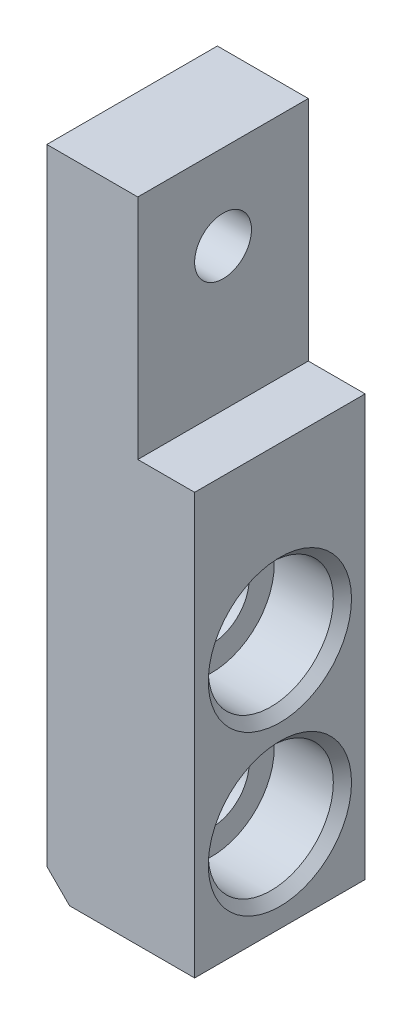
ISO-10303-21;
HEADER;
FILE_DESCRIPTION(('STEP AP214'),'2;1');
FILE_NAME('part.step','',(''),(''),'','','');
FILE_SCHEMA(('AUTOMOTIVE_DESIGN { 1 0 10303 214 1 1 1 1 }'));
ENDSEC;
DATA;
#1=APPLICATION_CONTEXT('core data for automotive mechanical design processes');
#2=APPLICATION_PROTOCOL_DEFINITION('international standard','automotive_design',2000,#1);
#3=PRODUCT_CONTEXT('',#1,'mechanical');
#4=PRODUCT('Part','Part','',(#3));
#5=PRODUCT_RELATED_PRODUCT_CATEGORY('part','',(#4));
#6=PRODUCT_DEFINITION_FORMATION('','',#4);
#7=PRODUCT_DEFINITION_CONTEXT('part definition',#1,'design');
#8=PRODUCT_DEFINITION('design','',#6,#7);
#9=PRODUCT_DEFINITION_SHAPE('','',#8);
#10=(LENGTH_UNIT() NAMED_UNIT(*) SI_UNIT(.MILLI.,.METRE.));
#11=(NAMED_UNIT(*) PLANE_ANGLE_UNIT() SI_UNIT($,.RADIAN.));
#12=(NAMED_UNIT(*) SI_UNIT($,.STERADIAN.) SOLID_ANGLE_UNIT());
#13=UNCERTAINTY_MEASURE_WITH_UNIT(LENGTH_MEASURE(1.E-05),#10,'distance_accuracy_value','');
#14=(GEOMETRIC_REPRESENTATION_CONTEXT(3) GLOBAL_UNCERTAINTY_ASSIGNED_CONTEXT((#13)) GLOBAL_UNIT_ASSIGNED_CONTEXT((#10,
#11,#12)) REPRESENTATION_CONTEXT('',''));
#15=CARTESIAN_POINT('',(0.,0.,0.));
#16=DIRECTION('',(0.,0.,1.));
#17=DIRECTION('',(1.,0.,0.));
#18=AXIS2_PLACEMENT_3D('',#15,#16,#17);
#19=CARTESIAN_POINT('',(30.0149943953332,-2.6294881451428,-43.9419098460141));
#20=DIRECTION('',(0.,1.,0.));
#21=DIRECTION('',(0.,0.,1.));
#22=AXIS2_PLACEMENT_3D('',#19,#20,#21);
#23=PLANE('',#22);
#24=DIRECTION('',(-1.,0.,0.));
#25=VECTOR('',#24,1.);
#26=CARTESIAN_POINT('',(30.0149943953333,-2.6294881451428,-28.9419098460143));
#27=LINE('',#26,#25);
#28=CARTESIAN_POINT('',(30.0149943953333,-2.6294881451428,-28.9419098460143));
#29=VERTEX_POINT('',#28);
#30=CARTESIAN_POINT('',(19.0149943953333,-2.62948814514284,-28.9419098460142));
#31=VERTEX_POINT('',#30);
#32=EDGE_CURVE('E112',#29,#31,#27,.T.);
#33=ORIENTED_EDGE('',*,*,#32,.T.);
#34=DIRECTION('',(0.,0.,-1.));
#35=VECTOR('',#34,1.);
#36=CARTESIAN_POINT('',(19.0149943953332,-2.62948814514284,-43.9419098460141));
#37=LINE('',#36,#35);
#38=CARTESIAN_POINT('',(19.0149943953332,-2.62948814514284,-43.9419098460141));
#39=VERTEX_POINT('',#38);
#40=EDGE_CURVE('E126',#31,#39,#37,.T.);
#41=ORIENTED_EDGE('',*,*,#40,.T.);
#42=DIRECTION('',(-1.,0.,0.));
#43=VECTOR('',#42,1.);
#44=CARTESIAN_POINT('',(30.0149943953332,-2.6294881451428,-43.9419098460141));
#45=LINE('',#44,#43);
#46=CARTESIAN_POINT('',(30.0149943953332,-2.6294881451428,-43.9419098460141));
#47=VERTEX_POINT('',#46);
#48=EDGE_CURVE('E123',#47,#39,#45,.T.);
#49=ORIENTED_EDGE('',*,*,#48,.F.);
#50=DIRECTION('',(0.,0.,-1.));
#51=VECTOR('',#50,1.);
#52=CARTESIAN_POINT('',(30.0149943953332,-2.6294881451428,-43.9419098460141));
#53=LINE('',#52,#51);
#54=EDGE_CURVE('E104',#29,#47,#53,.T.);
#55=ORIENTED_EDGE('',*,*,#54,.F.);
#56=EDGE_LOOP('',(#33,#41,#49,#55));
#57=FACE_BOUND('',#56,.T.);
#58=ADVANCED_FACE('F16',(#57),#23,.F.);
#59=CARTESIAN_POINT('',(30.0149943953329,54.3705118548572,-43.9419098460141));
#60=DIRECTION('',(0.,0.,1.));
#61=DIRECTION('',(0.,-1.,0.));
#62=AXIS2_PLACEMENT_3D('',#59,#60,#61);
#63=PLANE('',#62);
#64=DIRECTION('',(0.,1.,0.));
#65=VECTOR('',#64,1.);
#66=CARTESIAN_POINT('',(25.014994395333,34.3705118548579,-43.9419098460141));
#67=LINE('',#66,#65);
#68=CARTESIAN_POINT('',(25.014994395333,34.3705118548579,-43.9419098460141));
#69=VERTEX_POINT('',#68);
#70=CARTESIAN_POINT('',(25.0149943953329,54.3705118548572,-43.9419098460141));
#71=VERTEX_POINT('',#70);
#72=EDGE_CURVE('E86',#69,#71,#67,.T.);
#73=ORIENTED_EDGE('',*,*,#72,.F.);
#74=DIRECTION('',(1.,0.,0.));
#75=VECTOR('',#74,1.);
#76=CARTESIAN_POINT('',(25.014994395333,34.3705118548579,-43.9419098460141));
#77=LINE('',#76,#75);
#78=CARTESIAN_POINT('',(30.014994395333,34.3705118548579,-43.9419098460141));
#79=VERTEX_POINT('',#78);
#80=EDGE_CURVE('E73',#69,#79,#77,.T.);
#81=ORIENTED_EDGE('',*,*,#80,.T.);
#82=DIRECTION('',(0.,1.,0.));
#83=VECTOR('',#82,1.);
#84=CARTESIAN_POINT('',(30.0149943953329,54.3705118548572,-43.9419098460141));
#85=LINE('',#84,#83);
#86=EDGE_CURVE('E107',#47,#79,#85,.T.);
#87=ORIENTED_EDGE('',*,*,#86,.F.);
#88=ORIENTED_EDGE('',*,*,#48,.T.);
#89=DIRECTION('',(-0.707106781186548,0.707106781186548,0.));
#90=VECTOR('',#89,1.);
#91=CARTESIAN_POINT('',(19.0149943953332,-2.62948814514284,-43.9419098460141));
#92=LINE('',#91,#90);
#93=CARTESIAN_POINT('',(17.0149943953331,-0.629488145142812,-43.9419098460141));
#94=VERTEX_POINT('',#93);
#95=EDGE_CURVE('E129',#39,#94,#92,.T.);
#96=ORIENTED_EDGE('',*,*,#95,.T.);
#97=DIRECTION('',(0.,1.,0.));
#98=VECTOR('',#97,1.);
#99=CARTESIAN_POINT('',(17.014994395333,54.3705118548572,-43.941909846014));
#100=LINE('',#99,#98);
#101=CARTESIAN_POINT('',(17.014994395333,54.3705118548572,-43.941909846014));
#102=VERTEX_POINT('',#101);
#103=EDGE_CURVE('E102',#94,#102,#100,.T.);
#104=ORIENTED_EDGE('',*,*,#103,.T.);
#105=DIRECTION('',(-1.,0.,0.));
#106=VECTOR('',#105,1.);
#107=CARTESIAN_POINT('',(30.0149943953329,54.3705118548572,-43.9419098460141));
#108=LINE('',#107,#106);
#109=EDGE_CURVE('E93',#71,#102,#108,.T.);
#110=ORIENTED_EDGE('',*,*,#109,.F.);
#111=EDGE_LOOP('',(#73,#81,#87,#88,#96,#104,#110));
#112=FACE_BOUND('',#111,.T.);
#113=ADVANCED_FACE('F91',(#112),#63,.F.);
#114=CARTESIAN_POINT('',(30.0149943953331,54.3705118548572,-28.9419098460143));
#115=DIRECTION('',(0.,-1.,0.));
#116=DIRECTION('',(0.,0.,-1.));
#117=AXIS2_PLACEMENT_3D('',#114,#115,#116);
#118=PLANE('',#117);
#119=DIRECTION('',(-1.,0.,0.));
#120=VECTOR('',#119,1.);
#121=CARTESIAN_POINT('',(30.0149943953331,54.3705118548572,-28.9419098460143));
#122=LINE('',#121,#120);
#123=CARTESIAN_POINT('',(25.0149943953331,54.3705118548572,-28.9419098460143));
#124=VERTEX_POINT('',#123);
#125=CARTESIAN_POINT('',(17.0149943953331,54.3705118548572,-28.9419098460142));
#126=VERTEX_POINT('',#125);
#127=EDGE_CURVE('E120',#124,#126,#122,.T.);
#128=ORIENTED_EDGE('',*,*,#127,.F.);
#129=DIRECTION('',(0.,0.,1.));
#130=VECTOR('',#129,1.);
#131=CARTESIAN_POINT('',(25.0149943953329,54.3705118548572,-43.9419098460141));
#132=LINE('',#131,#130);
#133=EDGE_CURVE('E94',#71,#124,#132,.T.);
#134=ORIENTED_EDGE('',*,*,#133,.F.);
#135=ORIENTED_EDGE('',*,*,#109,.T.);
#136=DIRECTION('',(0.,0.,1.));
#137=VECTOR('',#136,1.);
#138=CARTESIAN_POINT('',(17.0149943953331,54.3705118548572,-28.9419098460142));
#139=LINE('',#138,#137);
#140=EDGE_CURVE('E114',#102,#126,#139,.T.);
#141=ORIENTED_EDGE('',*,*,#140,.T.);
#142=EDGE_LOOP('',(#128,#134,#135,#141));
#143=FACE_BOUND('',#142,.T.);
#144=ADVANCED_FACE('F146',(#143),#118,.F.);
#145=CARTESIAN_POINT('',(30.0149943953333,-2.6294881451428,-28.9419098460143));
#146=DIRECTION('',(0.,0.,-1.));
#147=DIRECTION('',(0.,1.,0.));
#148=AXIS2_PLACEMENT_3D('',#145,#146,#147);
#149=PLANE('',#148);
#150=DIRECTION('',(0.,-1.,0.));
#151=VECTOR('',#150,1.);
#152=CARTESIAN_POINT('',(30.0149943953333,-2.6294881451428,-28.9419098460143));
#153=LINE('',#152,#151);
#154=CARTESIAN_POINT('',(30.0149943953331,34.3705118548579,-28.9419098460143));
#155=VERTEX_POINT('',#154);
#156=EDGE_CURVE('E110',#155,#29,#153,.T.);
#157=ORIENTED_EDGE('',*,*,#156,.F.);
#158=DIRECTION('',(1.,0.,0.));
#159=VECTOR('',#158,1.);
#160=CARTESIAN_POINT('',(25.0149943953331,34.3705118548579,-28.9419098460143));
#161=LINE('',#160,#159);
#162=CARTESIAN_POINT('',(25.0149943953331,34.3705118548579,-28.9419098460143));
#163=VERTEX_POINT('',#162);
#164=EDGE_CURVE('E31',#163,#155,#161,.T.);
#165=ORIENTED_EDGE('',*,*,#164,.F.);
#166=DIRECTION('',(0.,-1.,0.));
#167=VECTOR('',#166,1.);
#168=CARTESIAN_POINT('',(25.0149943953331,34.3705118548579,-28.9419098460143));
#169=LINE('',#168,#167);
#170=EDGE_CURVE('E82',#124,#163,#169,.T.);
#171=ORIENTED_EDGE('',*,*,#170,.F.);
#172=ORIENTED_EDGE('',*,*,#127,.T.);
#173=DIRECTION('',(0.,-1.,0.));
#174=VECTOR('',#173,1.);
#175=CARTESIAN_POINT('',(17.0149943953333,-2.62948814514284,-28.9419098460142));
#176=LINE('',#175,#174);
#177=CARTESIAN_POINT('',(17.0149943953333,-0.629488145142826,-28.9419098460142));
#178=VERTEX_POINT('',#177);
#179=EDGE_CURVE('E108',#126,#178,#176,.T.);
#180=ORIENTED_EDGE('',*,*,#179,.T.);
#181=DIRECTION('',(0.707106781186548,-0.707106781186548,0.));
#182=VECTOR('',#181,1.);
#183=CARTESIAN_POINT('',(19.0149943953333,-2.62948814514284,-28.9419098460142));
#184=LINE('',#183,#182);
#185=EDGE_CURVE('E10',#178,#31,#184,.T.);
#186=ORIENTED_EDGE('',*,*,#185,.T.);
#187=ORIENTED_EDGE('',*,*,#32,.F.);
#188=EDGE_LOOP('',(#157,#165,#171,#172,#180,#186,#187));
#189=FACE_BOUND('',#188,.T.);
#190=ADVANCED_FACE('F139',(#189),#149,.F.);
#191=CARTESIAN_POINT('',(30.0149943953332,97.4468872021407,19.3545631930474));
#192=DIRECTION('',(-1.,0.,0.));
#193=DIRECTION('',(0.,0.,1.));
#194=AXIS2_PLACEMENT_3D('',#191,#192,#193);
#195=PLANE('',#194);
#196=CARTESIAN_POINT('',(30.0149943953332,5.37051185485751,-36.4419098460141));
#197=DIRECTION('',(1.,0.,0.));
#198=DIRECTION('',(0.,0.,-1.));
#199=AXIS2_PLACEMENT_3D('',#196,#197,#198);
#200=CIRCLE('',#199,6.3);
#201=CARTESIAN_POINT('',(30.0149943953331,5.37051185485751,-42.7419098460141));
#202=VERTEX_POINT('',#201);
#203=EDGE_CURVE('E324',#202,#202,#200,.T.);
#204=ORIENTED_EDGE('',*,*,#203,.F.);
#205=EDGE_LOOP('',(#204));
#206=FACE_BOUND('',#205,.T.);
#207=CARTESIAN_POINT('',(30.0149943953331,19.3705118548576,-36.441909846014));
#208=DIRECTION('',(1.,0.,0.));
#209=DIRECTION('',(0.,0.,-1.));
#210=AXIS2_PLACEMENT_3D('',#207,#208,#209);
#211=CIRCLE('',#210,6.3);
#212=CARTESIAN_POINT('',(30.0149943953331,19.3705118548576,-42.7419098460141));
#213=VERTEX_POINT('',#212);
#214=EDGE_CURVE('E341',#213,#213,#211,.T.);
#215=ORIENTED_EDGE('',*,*,#214,.F.);
#216=EDGE_LOOP('',(#215));
#217=FACE_BOUND('',#216,.T.);
#218=ORIENTED_EDGE('',*,*,#86,.T.);
#219=DIRECTION('',(0.,0.,-1.));
#220=VECTOR('',#219,1.);
#221=CARTESIAN_POINT('',(30.014994395333,34.3705118548579,-43.9419098460141));
#222=LINE('',#221,#220);
#223=EDGE_CURVE('E78',#155,#79,#222,.T.);
#224=ORIENTED_EDGE('',*,*,#223,.F.);
#225=ORIENTED_EDGE('',*,*,#156,.T.);
#226=ORIENTED_EDGE('',*,*,#54,.T.);
#227=EDGE_LOOP('',(#218,#224,#225,#226));
#228=FACE_BOUND('',#227,.T.);
#229=ADVANCED_FACE('F143',(#206,#217,#228),#195,.F.);
#230=CARTESIAN_POINT('',(17.0149943953332,97.4468872021406,19.3545631930475));
#231=DIRECTION('',(-1.,0.,0.));
#232=DIRECTION('',(0.,0.,1.));
#233=AXIS2_PLACEMENT_3D('',#230,#231,#232);
#234=PLANE('',#233);
#235=CARTESIAN_POINT('',(17.014994395333,46.8886434221681,-36.4419098460141));
#236=DIRECTION('',(-1.,0.,0.));
#237=DIRECTION('',(0.,0.,1.));
#238=AXIS2_PLACEMENT_3D('',#235,#236,#237);
#239=CIRCLE('',#238,2.5);
#240=CARTESIAN_POINT('',(17.014994395333,46.8886434221681,-33.9419098460141));
#241=VERTEX_POINT('',#240);
#242=EDGE_CURVE('E319',#241,#241,#239,.T.);
#243=ORIENTED_EDGE('',*,*,#242,.F.);
#244=EDGE_LOOP('',(#243));
#245=FACE_BOUND('',#244,.T.);
#246=CARTESIAN_POINT('',(17.0149943953329,5.37051185485751,-36.441909846014));
#247=DIRECTION('',(1.,0.,0.));
#248=DIRECTION('',(0.,0.,-1.));
#249=AXIS2_PLACEMENT_3D('',#246,#247,#248);
#250=CIRCLE('',#249,3.30000000000001);
#251=CARTESIAN_POINT('',(17.0149943953329,5.37051185485751,-39.741909846014));
#252=VERTEX_POINT('',#251);
#253=EDGE_CURVE('E338',#252,#252,#250,.T.);
#254=ORIENTED_EDGE('',*,*,#253,.T.);
#255=EDGE_LOOP('',(#254));
#256=FACE_BOUND('',#255,.T.);
#257=CARTESIAN_POINT('',(17.0149943953328,19.3705118548576,-36.441909846014));
#258=DIRECTION('',(1.,0.,0.));
#259=DIRECTION('',(0.,0.,-1.));
#260=AXIS2_PLACEMENT_3D('',#257,#258,#259);
#261=CIRCLE('',#260,3.30000000000001);
#262=CARTESIAN_POINT('',(17.0149943953328,19.3705118548576,-39.741909846014));
#263=VERTEX_POINT('',#262);
#264=EDGE_CURVE('E101',#263,#263,#261,.T.);
#265=ORIENTED_EDGE('',*,*,#264,.T.);
#266=EDGE_LOOP('',(#265));
#267=FACE_BOUND('',#266,.T.);
#268=ORIENTED_EDGE('',*,*,#103,.F.);
#269=DIRECTION('',(0.,0.,1.));
#270=VECTOR('',#269,1.);
#271=CARTESIAN_POINT('',(17.0149943953333,-0.629488145142826,-28.9419098460142));
#272=LINE('',#271,#270);
#273=EDGE_CURVE('E24',#94,#178,#272,.T.);
#274=ORIENTED_EDGE('',*,*,#273,.T.);
#275=ORIENTED_EDGE('',*,*,#179,.F.);
#276=ORIENTED_EDGE('',*,*,#140,.F.);
#277=EDGE_LOOP('',(#268,#274,#275,#276));
#278=FACE_BOUND('',#277,.T.);
#279=ADVANCED_FACE('F134',(#245,#256,#267,#278),#234,.T.);
#280=CARTESIAN_POINT('',(19.0149943953332,-2.62948814514284,-43.9419098460141));
#281=DIRECTION('',(-0.707106781186548,-0.707106781186548,0.));
#282=DIRECTION('',(0.,0.,1.));
#283=AXIS2_PLACEMENT_3D('',#280,#281,#282);
#284=PLANE('',#283);
#285=ORIENTED_EDGE('',*,*,#185,.F.);
#286=ORIENTED_EDGE('',*,*,#273,.F.);
#287=ORIENTED_EDGE('',*,*,#95,.F.);
#288=ORIENTED_EDGE('',*,*,#40,.F.);
#289=EDGE_LOOP('',(#285,#286,#287,#288));
#290=FACE_BOUND('',#289,.T.);
#291=ADVANCED_FACE('F18',(#290),#284,.T.);
#292=CARTESIAN_POINT('',(25.014994395333,34.3705118548579,-43.9419098460141));
#293=DIRECTION('',(0.,-1.,0.));
#294=DIRECTION('',(0.,0.,-1.));
#295=AXIS2_PLACEMENT_3D('',#292,#293,#294);
#296=PLANE('',#295);
#297=ORIENTED_EDGE('',*,*,#223,.T.);
#298=ORIENTED_EDGE('',*,*,#80,.F.);
#299=DIRECTION('',(0.,0.,-1.));
#300=VECTOR('',#299,1.);
#301=CARTESIAN_POINT('',(25.014994395333,34.3705118548579,-43.9419098460141));
#302=LINE('',#301,#300);
#303=EDGE_CURVE('E76',#163,#69,#302,.T.);
#304=ORIENTED_EDGE('',*,*,#303,.F.);
#305=ORIENTED_EDGE('',*,*,#164,.T.);
#306=EDGE_LOOP('',(#297,#298,#304,#305));
#307=FACE_BOUND('',#306,.T.);
#308=ADVANCED_FACE('F75',(#307),#296,.F.);
#309=CARTESIAN_POINT('',(25.0149943953332,97.4468872021406,19.3545631930475));
#310=DIRECTION('',(-1.,0.,0.));
#311=DIRECTION('',(0.,0.,1.));
#312=AXIS2_PLACEMENT_3D('',#309,#310,#311);
#313=PLANE('',#312);
#314=CARTESIAN_POINT('',(25.014994395333,46.8886434221681,-36.4419098460142));
#315=DIRECTION('',(1.,0.,0.));
#316=DIRECTION('',(0.,0.,-1.));
#317=AXIS2_PLACEMENT_3D('',#314,#315,#316);
#318=CIRCLE('',#317,2.5);
#319=CARTESIAN_POINT('',(25.014994395333,46.8886434221681,-38.9419098460142));
#320=VERTEX_POINT('',#319);
#321=EDGE_CURVE('E322',#320,#320,#318,.T.);
#322=ORIENTED_EDGE('',*,*,#321,.F.);
#323=EDGE_LOOP('',(#322));
#324=FACE_BOUND('',#323,.T.);
#325=ORIENTED_EDGE('',*,*,#303,.T.);
#326=ORIENTED_EDGE('',*,*,#72,.T.);
#327=ORIENTED_EDGE('',*,*,#133,.T.);
#328=ORIENTED_EDGE('',*,*,#170,.T.);
#329=EDGE_LOOP('',(#325,#326,#327,#328));
#330=FACE_BOUND('',#329,.T.);
#331=ADVANCED_FACE('F85',(#324,#330),#313,.F.);
#332=CARTESIAN_POINT('',(30.0149943953331,19.3705118548576,-36.441909846014));
#333=DIRECTION('',(1.,0.,0.));
#334=DIRECTION('',(0.,0.,-1.));
#335=AXIS2_PLACEMENT_3D('',#332,#333,#334);
#336=CYLINDRICAL_SURFACE('',#335,3.30000000000001);
#337=ORIENTED_EDGE('',*,*,#264,.F.);
#338=EDGE_LOOP('',(#337));
#339=FACE_BOUND('',#338,.T.);
#340=CARTESIAN_POINT('',(24.0149943953331,19.3705118548576,-36.441909846014));
#341=DIRECTION('',(1.,0.,0.));
#342=DIRECTION('',(0.,0.,-1.));
#343=AXIS2_PLACEMENT_3D('',#340,#341,#342);
#344=CIRCLE('',#343,3.3);
#345=CARTESIAN_POINT('',(24.0149943953331,19.3705118548576,-39.741909846014));
#346=VERTEX_POINT('',#345);
#347=EDGE_CURVE('E350',#346,#346,#344,.T.);
#348=ORIENTED_EDGE('',*,*,#347,.T.);
#349=EDGE_LOOP('',(#348));
#350=FACE_BOUND('',#349,.T.);
#351=ADVANCED_FACE('F220',(#339,#350),#336,.F.);
#352=CARTESIAN_POINT('',(24.0149943953331,24.8705118548576,-36.441909846014));
#353=DIRECTION('',(-1.,0.,0.));
#354=DIRECTION('',(0.,0.,1.));
#355=AXIS2_PLACEMENT_3D('',#352,#353,#354);
#356=PLANE('',#355);
#357=ORIENTED_EDGE('',*,*,#347,.F.);
#358=EDGE_LOOP('',(#357));
#359=FACE_BOUND('',#358,.T.);
#360=CARTESIAN_POINT('',(24.0149943953331,19.3705118548576,-36.441909846014));
#361=DIRECTION('',(1.,0.,0.));
#362=DIRECTION('',(0.,0.,-1.));
#363=AXIS2_PLACEMENT_3D('',#360,#361,#362);
#364=CIRCLE('',#363,5.5);
#365=CARTESIAN_POINT('',(24.0149943953331,19.3705118548576,-41.941909846014));
#366=VERTEX_POINT('',#365);
#367=EDGE_CURVE('E347',#366,#366,#364,.T.);
#368=ORIENTED_EDGE('',*,*,#367,.T.);
#369=EDGE_LOOP('',(#368));
#370=FACE_BOUND('',#369,.T.);
#371=ADVANCED_FACE('F230',(#359,#370),#356,.F.);
#372=CARTESIAN_POINT('',(30.0149943953331,19.3705118548576,-36.441909846014));
#373=DIRECTION('',(1.,0.,0.));
#374=DIRECTION('',(0.,0.,-1.));
#375=AXIS2_PLACEMENT_3D('',#372,#373,#374);
#376=CYLINDRICAL_SURFACE('',#375,5.5);
#377=ORIENTED_EDGE('',*,*,#367,.F.);
#378=EDGE_LOOP('',(#377));
#379=FACE_BOUND('',#378,.T.);
#380=CARTESIAN_POINT('',(29.2149943953331,19.3705118548576,-36.441909846014));
#381=DIRECTION('',(1.,0.,0.));
#382=DIRECTION('',(0.,0.,-1.));
#383=AXIS2_PLACEMENT_3D('',#380,#381,#382);
#384=CIRCLE('',#383,5.5);
#385=CARTESIAN_POINT('',(29.2149943953331,19.3705118548576,-41.941909846014));
#386=VERTEX_POINT('',#385);
#387=EDGE_CURVE('E344',#386,#386,#384,.T.);
#388=ORIENTED_EDGE('',*,*,#387,.T.);
#389=EDGE_LOOP('',(#388));
#390=FACE_BOUND('',#389,.T.);
#391=ADVANCED_FACE('F240',(#379,#390),#376,.F.);
#392=CARTESIAN_POINT('',(30.0149943953331,19.3705118548576,-36.441909846014));
#393=DIRECTION('',(1.,0.,0.));
#394=DIRECTION('',(0.,0.,-1.));
#395=AXIS2_PLACEMENT_3D('',#392,#393,#394);
#396=CONICAL_SURFACE('',#395,6.3,0.785398163397446);
#397=ORIENTED_EDGE('',*,*,#387,.F.);
#398=EDGE_LOOP('',(#397));
#399=FACE_BOUND('',#398,.T.);
#400=ORIENTED_EDGE('',*,*,#214,.T.);
#401=EDGE_LOOP('',(#400));
#402=FACE_BOUND('',#401,.T.);
#403=ADVANCED_FACE('F250',(#399,#402),#396,.F.);
#404=CARTESIAN_POINT('',(30.0149943953332,5.37051185485751,-36.4419098460141));
#405=DIRECTION('',(1.,0.,0.));
#406=DIRECTION('',(0.,0.,-1.));
#407=AXIS2_PLACEMENT_3D('',#404,#405,#406);
#408=CYLINDRICAL_SURFACE('',#407,3.30000000000001);
#409=ORIENTED_EDGE('',*,*,#253,.F.);
#410=EDGE_LOOP('',(#409));
#411=FACE_BOUND('',#410,.T.);
#412=CARTESIAN_POINT('',(24.0149943953332,5.37051185485753,-36.4419098460141));
#413=DIRECTION('',(1.,0.,0.));
#414=DIRECTION('',(0.,0.,-1.));
#415=AXIS2_PLACEMENT_3D('',#412,#413,#414);
#416=CIRCLE('',#415,3.30000000000001);
#417=CARTESIAN_POINT('',(24.0149943953332,5.37051185485753,-39.7419098460141));
#418=VERTEX_POINT('',#417);
#419=EDGE_CURVE('E335',#418,#418,#416,.T.);
#420=ORIENTED_EDGE('',*,*,#419,.T.);
#421=EDGE_LOOP('',(#420));
#422=FACE_BOUND('',#421,.T.);
#423=ADVANCED_FACE('F260',(#411,#422),#408,.F.);
#424=CARTESIAN_POINT('',(24.0149943953332,10.8705118548575,-36.4419098460141));
#425=DIRECTION('',(-1.,0.,0.));
#426=DIRECTION('',(0.,0.,1.));
#427=AXIS2_PLACEMENT_3D('',#424,#425,#426);
#428=PLANE('',#427);
#429=ORIENTED_EDGE('',*,*,#419,.F.);
#430=EDGE_LOOP('',(#429));
#431=FACE_BOUND('',#430,.T.);
#432=CARTESIAN_POINT('',(24.0149943953332,5.37051185485753,-36.4419098460141));
#433=DIRECTION('',(1.,0.,0.));
#434=DIRECTION('',(0.,0.,-1.));
#435=AXIS2_PLACEMENT_3D('',#432,#433,#434);
#436=CIRCLE('',#435,5.5);
#437=CARTESIAN_POINT('',(24.0149943953331,5.37051185485753,-41.9419098460141));
#438=VERTEX_POINT('',#437);
#439=EDGE_CURVE('E332',#438,#438,#436,.T.);
#440=ORIENTED_EDGE('',*,*,#439,.T.);
#441=EDGE_LOOP('',(#440));
#442=FACE_BOUND('',#441,.T.);
#443=ADVANCED_FACE('F270',(#431,#442),#428,.F.);
#444=CARTESIAN_POINT('',(30.0149943953332,5.37051185485751,-36.4419098460141));
#445=DIRECTION('',(1.,0.,0.));
#446=DIRECTION('',(0.,0.,-1.));
#447=AXIS2_PLACEMENT_3D('',#444,#445,#446);
#448=CYLINDRICAL_SURFACE('',#447,5.5);
#449=ORIENTED_EDGE('',*,*,#439,.F.);
#450=EDGE_LOOP('',(#449));
#451=FACE_BOUND('',#450,.T.);
#452=CARTESIAN_POINT('',(29.2149943953332,5.37051185485751,-36.4419098460141));
#453=DIRECTION('',(1.,0.,0.));
#454=DIRECTION('',(0.,0.,-1.));
#455=AXIS2_PLACEMENT_3D('',#452,#453,#454);
#456=CIRCLE('',#455,5.5);
#457=CARTESIAN_POINT('',(29.2149943953331,5.37051185485751,-41.9419098460141));
#458=VERTEX_POINT('',#457);
#459=EDGE_CURVE('E329',#458,#458,#456,.T.);
#460=ORIENTED_EDGE('',*,*,#459,.T.);
#461=EDGE_LOOP('',(#460));
#462=FACE_BOUND('',#461,.T.);
#463=ADVANCED_FACE('F280',(#451,#462),#448,.F.);
#464=CARTESIAN_POINT('',(30.0149943953332,5.37051185485751,-36.4419098460141));
#465=DIRECTION('',(1.,0.,0.));
#466=DIRECTION('',(0.,0.,-1.));
#467=AXIS2_PLACEMENT_3D('',#464,#465,#466);
#468=CONICAL_SURFACE('',#467,6.3,0.785398163397446);
#469=ORIENTED_EDGE('',*,*,#459,.F.);
#470=EDGE_LOOP('',(#469));
#471=FACE_BOUND('',#470,.T.);
#472=ORIENTED_EDGE('',*,*,#203,.T.);
#473=EDGE_LOOP('',(#472));
#474=FACE_BOUND('',#473,.T.);
#475=ADVANCED_FACE('F290',(#471,#474),#468,.F.);
#476=CARTESIAN_POINT('',(15.014994395333,46.8886434221681,-36.4419098460141));
#477=DIRECTION('',(1.,0.,0.));
#478=DIRECTION('',(0.,0.,-1.));
#479=AXIS2_PLACEMENT_3D('',#476,#477,#478);
#480=CYLINDRICAL_SURFACE('',#479,2.5);
#481=ORIENTED_EDGE('',*,*,#242,.T.);
#482=EDGE_LOOP('',(#481));
#483=FACE_BOUND('',#482,.T.);
#484=ORIENTED_EDGE('',*,*,#321,.T.);
#485=EDGE_LOOP('',(#484));
#486=FACE_BOUND('',#485,.T.);
#487=ADVANCED_FACE('F300',(#483,#486),#480,.F.);
#488=CLOSED_SHELL('',(#58,#113,#144,#190,#229,#279,#291,#308,#331,#351,#371,#391,#403,#423,#443,
#463,#475,#487));
#489=MANIFOLD_SOLID_BREP('B1',#488);
#490=ADVANCED_BREP_SHAPE_REPRESENTATION('',(#18,#489),#14);
#491=SHAPE_DEFINITION_REPRESENTATION(#9,#490);
ENDSEC;
END-ISO-10303-21;
